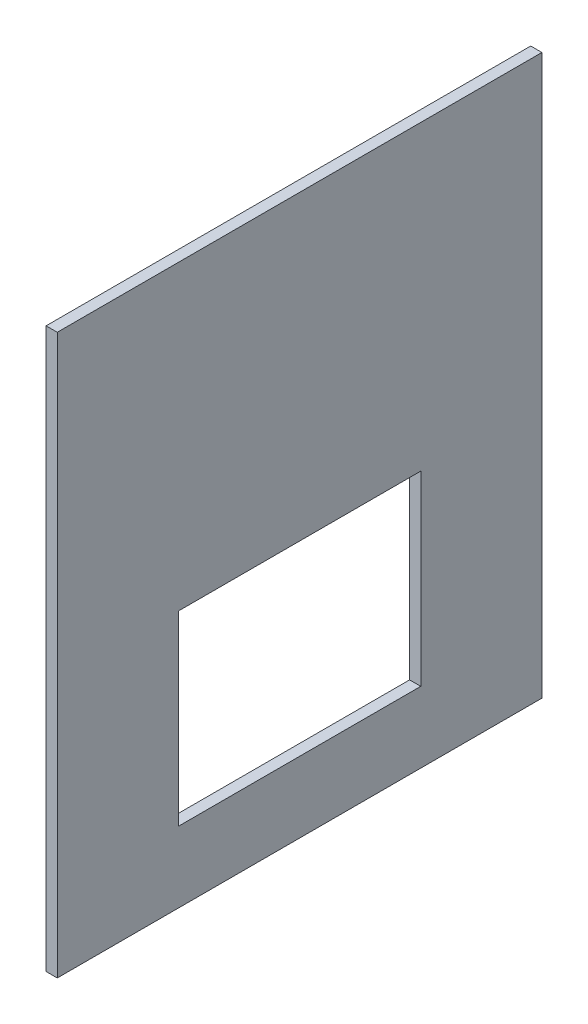
ISO-10303-21;
HEADER;
FILE_DESCRIPTION(('STEP AP214'),'2;1');
FILE_NAME('part.step','',(''),(''),'','','');
FILE_SCHEMA(('AUTOMOTIVE_DESIGN { 1 0 10303 214 1 1 1 1 }'));
ENDSEC;
DATA;
#1=APPLICATION_CONTEXT('core data for automotive mechanical design processes');
#2=APPLICATION_PROTOCOL_DEFINITION('international standard','automotive_design',2000,#1);
#3=PRODUCT_CONTEXT('',#1,'mechanical');
#4=PRODUCT('Part','Part','',(#3));
#5=PRODUCT_RELATED_PRODUCT_CATEGORY('part','',(#4));
#6=PRODUCT_DEFINITION_FORMATION('','',#4);
#7=PRODUCT_DEFINITION_CONTEXT('part definition',#1,'design');
#8=PRODUCT_DEFINITION('design','',#6,#7);
#9=PRODUCT_DEFINITION_SHAPE('','',#8);
#10=(LENGTH_UNIT() NAMED_UNIT(*) SI_UNIT(.MILLI.,.METRE.));
#11=(NAMED_UNIT(*) PLANE_ANGLE_UNIT() SI_UNIT($,.RADIAN.));
#12=(NAMED_UNIT(*) SI_UNIT($,.STERADIAN.) SOLID_ANGLE_UNIT());
#13=UNCERTAINTY_MEASURE_WITH_UNIT(LENGTH_MEASURE(1.E-05),#10,'distance_accuracy_value','');
#14=(GEOMETRIC_REPRESENTATION_CONTEXT(3) GLOBAL_UNCERTAINTY_ASSIGNED_CONTEXT((#13)) GLOBAL_UNIT_ASSIGNED_CONTEXT((#10,
#11,#12)) REPRESENTATION_CONTEXT('',''));
#15=CARTESIAN_POINT('',(0.,0.,0.));
#16=DIRECTION('',(0.,0.,1.));
#17=DIRECTION('',(1.,0.,0.));
#18=AXIS2_PLACEMENT_3D('',#15,#16,#17);
#19=CARTESIAN_POINT('',(3.,0.,0.));
#20=DIRECTION('',(-1.,0.,0.));
#21=DIRECTION('',(0.,0.,1.));
#22=AXIS2_PLACEMENT_3D('',#19,#20,#21);
#23=PLANE('',#22);
#24=DIRECTION('',(0.,-1.,0.));
#25=VECTOR('',#24,1.);
#26=CARTESIAN_POINT('',(3.,0.,0.));
#27=LINE('',#26,#25);
#28=CARTESIAN_POINT('',(3.,150.,0.));
#29=VERTEX_POINT('',#28);
#30=CARTESIAN_POINT('',(3.,0.,0.));
#31=VERTEX_POINT('',#30);
#32=EDGE_CURVE('E134',#29,#31,#27,.T.);
#33=ORIENTED_EDGE('',*,*,#32,.T.);
#34=DIRECTION('',(0.,0.,-1.));
#35=VECTOR('',#34,1.);
#36=CARTESIAN_POINT('',(3.,0.,0.));
#37=LINE('',#36,#35);
#38=CARTESIAN_POINT('',(3.,0.,-130.));
#39=VERTEX_POINT('',#38);
#40=EDGE_CURVE('E137',#31,#39,#37,.T.);
#41=ORIENTED_EDGE('',*,*,#40,.T.);
#42=DIRECTION('',(0.,1.,0.));
#43=VECTOR('',#42,1.);
#44=CARTESIAN_POINT('',(3.,0.,-130.));
#45=LINE('',#44,#43);
#46=CARTESIAN_POINT('',(3.,150.,-130.));
#47=VERTEX_POINT('',#46);
#48=EDGE_CURVE('E140',#39,#47,#45,.T.);
#49=ORIENTED_EDGE('',*,*,#48,.T.);
#50=DIRECTION('',(0.,0.,1.));
#51=VECTOR('',#50,1.);
#52=CARTESIAN_POINT('',(3.,150.,0.));
#53=LINE('',#52,#51);
#54=EDGE_CURVE('E142',#47,#29,#53,.T.);
#55=ORIENTED_EDGE('',*,*,#54,.T.);
#56=EDGE_LOOP('',(#33,#41,#49,#55));
#57=FACE_BOUND('',#56,.T.);
#58=DIRECTION('',(0.,-1.,0.));
#59=VECTOR('',#58,1.);
#60=CARTESIAN_POINT('',(3.,19.,-32.5));
#61=LINE('',#60,#59);
#62=CARTESIAN_POINT('',(3.,69.,-32.5));
#63=VERTEX_POINT('',#62);
#64=CARTESIAN_POINT('',(3.,19.,-32.5));
#65=VERTEX_POINT('',#64);
#66=EDGE_CURVE('E98',#63,#65,#61,.T.);
#67=ORIENTED_EDGE('',*,*,#66,.F.);
#68=DIRECTION('',(0.,0.,1.));
#69=VECTOR('',#68,1.);
#70=CARTESIAN_POINT('',(3.,69.,-32.5));
#71=LINE('',#70,#69);
#72=CARTESIAN_POINT('',(3.,69.,-97.5));
#73=VERTEX_POINT('',#72);
#74=EDGE_CURVE('E120',#73,#63,#71,.T.);
#75=ORIENTED_EDGE('',*,*,#74,.F.);
#76=DIRECTION('',(0.,1.,0.));
#77=VECTOR('',#76,1.);
#78=CARTESIAN_POINT('',(3.,19.,-97.5));
#79=LINE('',#78,#77);
#80=CARTESIAN_POINT('',(3.,19.,-97.5));
#81=VERTEX_POINT('',#80);
#82=EDGE_CURVE('E118',#81,#73,#79,.T.);
#83=ORIENTED_EDGE('',*,*,#82,.F.);
#84=DIRECTION('',(0.,0.,-1.));
#85=VECTOR('',#84,1.);
#86=CARTESIAN_POINT('',(3.,19.,-32.5));
#87=LINE('',#86,#85);
#88=EDGE_CURVE('E106',#65,#81,#87,.T.);
#89=ORIENTED_EDGE('',*,*,#88,.F.);
#90=EDGE_LOOP('',(#67,#75,#83,#89));
#91=FACE_BOUND('',#90,.T.);
#92=ADVANCED_FACE('F33',(#57,#91),#23,.F.);
#93=CARTESIAN_POINT('',(0.,0.,0.));
#94=DIRECTION('',(-1.,0.,0.));
#95=DIRECTION('',(0.,0.,1.));
#96=AXIS2_PLACEMENT_3D('',#93,#94,#95);
#97=PLANE('',#96);
#98=DIRECTION('',(0.,-1.,0.));
#99=VECTOR('',#98,1.);
#100=CARTESIAN_POINT('',(0.,0.,0.));
#101=LINE('',#100,#99);
#102=CARTESIAN_POINT('',(0.,150.,0.));
#103=VERTEX_POINT('',#102);
#104=CARTESIAN_POINT('',(0.,0.,0.));
#105=VERTEX_POINT('',#104);
#106=EDGE_CURVE('E114',#103,#105,#101,.T.);
#107=ORIENTED_EDGE('',*,*,#106,.F.);
#108=DIRECTION('',(0.,0.,1.));
#109=VECTOR('',#108,1.);
#110=CARTESIAN_POINT('',(0.,150.,0.));
#111=LINE('',#110,#109);
#112=CARTESIAN_POINT('',(0.,150.,-130.));
#113=VERTEX_POINT('',#112);
#114=EDGE_CURVE('E138',#113,#103,#111,.T.);
#115=ORIENTED_EDGE('',*,*,#114,.F.);
#116=DIRECTION('',(0.,1.,0.));
#117=VECTOR('',#116,1.);
#118=CARTESIAN_POINT('',(0.,0.,-130.));
#119=LINE('',#118,#117);
#120=CARTESIAN_POINT('',(0.,0.,-130.));
#121=VERTEX_POINT('',#120);
#122=EDGE_CURVE('E149',#121,#113,#119,.T.);
#123=ORIENTED_EDGE('',*,*,#122,.F.);
#124=DIRECTION('',(0.,0.,-1.));
#125=VECTOR('',#124,1.);
#126=CARTESIAN_POINT('',(0.,0.,0.));
#127=LINE('',#126,#125);
#128=EDGE_CURVE('E147',#105,#121,#127,.T.);
#129=ORIENTED_EDGE('',*,*,#128,.F.);
#130=EDGE_LOOP('',(#107,#115,#123,#129));
#131=FACE_BOUND('',#130,.T.);
#132=DIRECTION('',(0.,0.,1.));
#133=VECTOR('',#132,1.);
#134=CARTESIAN_POINT('',(0.,69.,-32.5));
#135=LINE('',#134,#133);
#136=CARTESIAN_POINT('',(0.,69.,-97.5));
#137=VERTEX_POINT('',#136);
#138=CARTESIAN_POINT('',(0.,69.,-32.5));
#139=VERTEX_POINT('',#138);
#140=EDGE_CURVE('E107',#137,#139,#135,.T.);
#141=ORIENTED_EDGE('',*,*,#140,.T.);
#142=DIRECTION('',(0.,-1.,0.));
#143=VECTOR('',#142,1.);
#144=CARTESIAN_POINT('',(0.,19.,-32.5));
#145=LINE('',#144,#143);
#146=CARTESIAN_POINT('',(0.,19.,-32.5));
#147=VERTEX_POINT('',#146);
#148=EDGE_CURVE('E56',#139,#147,#145,.T.);
#149=ORIENTED_EDGE('',*,*,#148,.T.);
#150=DIRECTION('',(0.,0.,-1.));
#151=VECTOR('',#150,1.);
#152=CARTESIAN_POINT('',(0.,19.,-32.5));
#153=LINE('',#152,#151);
#154=CARTESIAN_POINT('',(0.,19.,-97.5));
#155=VERTEX_POINT('',#154);
#156=EDGE_CURVE('E113',#147,#155,#153,.T.);
#157=ORIENTED_EDGE('',*,*,#156,.T.);
#158=DIRECTION('',(0.,1.,0.));
#159=VECTOR('',#158,1.);
#160=CARTESIAN_POINT('',(0.,19.,-97.5));
#161=LINE('',#160,#159);
#162=EDGE_CURVE('E126',#155,#137,#161,.T.);
#163=ORIENTED_EDGE('',*,*,#162,.T.);
#164=EDGE_LOOP('',(#141,#149,#157,#163));
#165=FACE_BOUND('',#164,.T.);
#166=ADVANCED_FACE('F167',(#131,#165),#97,.T.);
#167=CARTESIAN_POINT('',(3.,0.,0.));
#168=DIRECTION('',(0.,0.,-1.));
#169=DIRECTION('',(-1.,0.,0.));
#170=AXIS2_PLACEMENT_3D('',#167,#168,#169);
#171=PLANE('',#170);
#172=ORIENTED_EDGE('',*,*,#106,.T.);
#173=DIRECTION('',(-1.,0.,0.));
#174=VECTOR('',#173,1.);
#175=CARTESIAN_POINT('',(3.,0.,0.));
#176=LINE('',#175,#174);
#177=EDGE_CURVE('E11',#31,#105,#176,.T.);
#178=ORIENTED_EDGE('',*,*,#177,.F.);
#179=ORIENTED_EDGE('',*,*,#32,.F.);
#180=DIRECTION('',(-1.,0.,0.));
#181=VECTOR('',#180,1.);
#182=CARTESIAN_POINT('',(3.,150.,0.));
#183=LINE('',#182,#181);
#184=EDGE_CURVE('E144',#29,#103,#183,.T.);
#185=ORIENTED_EDGE('',*,*,#184,.T.);
#186=EDGE_LOOP('',(#172,#178,#179,#185));
#187=FACE_BOUND('',#186,.T.);
#188=ADVANCED_FACE('F35',(#187),#171,.F.);
#189=CARTESIAN_POINT('',(3.,0.,0.));
#190=DIRECTION('',(0.,1.,0.));
#191=DIRECTION('',(0.,0.,1.));
#192=AXIS2_PLACEMENT_3D('',#189,#190,#191);
#193=PLANE('',#192);
#194=ORIENTED_EDGE('',*,*,#128,.T.);
#195=DIRECTION('',(-1.,0.,0.));
#196=VECTOR('',#195,1.);
#197=CARTESIAN_POINT('',(3.,0.,-130.));
#198=LINE('',#197,#196);
#199=EDGE_CURVE('E41',#39,#121,#198,.T.);
#200=ORIENTED_EDGE('',*,*,#199,.F.);
#201=ORIENTED_EDGE('',*,*,#40,.F.);
#202=ORIENTED_EDGE('',*,*,#177,.T.);
#203=EDGE_LOOP('',(#194,#200,#201,#202));
#204=FACE_BOUND('',#203,.T.);
#205=ADVANCED_FACE('F177',(#204),#193,.F.);
#206=CARTESIAN_POINT('',(3.,0.,-130.));
#207=DIRECTION('',(0.,0.,1.));
#208=DIRECTION('',(1.,0.,0.));
#209=AXIS2_PLACEMENT_3D('',#206,#207,#208);
#210=PLANE('',#209);
#211=ORIENTED_EDGE('',*,*,#122,.T.);
#212=DIRECTION('',(-1.,0.,0.));
#213=VECTOR('',#212,1.);
#214=CARTESIAN_POINT('',(3.,150.,-130.));
#215=LINE('',#214,#213);
#216=EDGE_CURVE('E154',#47,#113,#215,.T.);
#217=ORIENTED_EDGE('',*,*,#216,.F.);
#218=ORIENTED_EDGE('',*,*,#48,.F.);
#219=ORIENTED_EDGE('',*,*,#199,.T.);
#220=EDGE_LOOP('',(#211,#217,#218,#219));
#221=FACE_BOUND('',#220,.T.);
#222=ADVANCED_FACE('F161',(#221),#210,.F.);
#223=CARTESIAN_POINT('',(3.,150.,0.));
#224=DIRECTION('',(0.,-1.,0.));
#225=DIRECTION('',(0.,0.,-1.));
#226=AXIS2_PLACEMENT_3D('',#223,#224,#225);
#227=PLANE('',#226);
#228=ORIENTED_EDGE('',*,*,#114,.T.);
#229=ORIENTED_EDGE('',*,*,#184,.F.);
#230=ORIENTED_EDGE('',*,*,#54,.F.);
#231=ORIENTED_EDGE('',*,*,#216,.T.);
#232=EDGE_LOOP('',(#228,#229,#230,#231));
#233=FACE_BOUND('',#232,.T.);
#234=ADVANCED_FACE('F171',(#233),#227,.F.);
#235=CARTESIAN_POINT('',(3.,19.,-32.5));
#236=DIRECTION('',(0.,0.,-1.));
#237=DIRECTION('',(-1.,0.,0.));
#238=AXIS2_PLACEMENT_3D('',#235,#236,#237);
#239=PLANE('',#238);
#240=ORIENTED_EDGE('',*,*,#148,.F.);
#241=DIRECTION('',(-1.,0.,0.));
#242=VECTOR('',#241,1.);
#243=CARTESIAN_POINT('',(3.,69.,-32.5));
#244=LINE('',#243,#242);
#245=EDGE_CURVE('E102',#63,#139,#244,.T.);
#246=ORIENTED_EDGE('',*,*,#245,.F.);
#247=ORIENTED_EDGE('',*,*,#66,.T.);
#248=DIRECTION('',(-1.,0.,0.));
#249=VECTOR('',#248,1.);
#250=CARTESIAN_POINT('',(3.,19.,-32.5));
#251=LINE('',#250,#249);
#252=EDGE_CURVE('E101',#65,#147,#251,.T.);
#253=ORIENTED_EDGE('',*,*,#252,.T.);
#254=EDGE_LOOP('',(#240,#246,#247,#253));
#255=FACE_BOUND('',#254,.T.);
#256=ADVANCED_FACE('F100',(#255),#239,.T.);
#257=CARTESIAN_POINT('',(3.,19.,-32.5));
#258=DIRECTION('',(0.,1.,0.));
#259=DIRECTION('',(0.,0.,1.));
#260=AXIS2_PLACEMENT_3D('',#257,#258,#259);
#261=PLANE('',#260);
#262=ORIENTED_EDGE('',*,*,#156,.F.);
#263=ORIENTED_EDGE('',*,*,#252,.F.);
#264=ORIENTED_EDGE('',*,*,#88,.T.);
#265=DIRECTION('',(-1.,0.,0.));
#266=VECTOR('',#265,1.);
#267=CARTESIAN_POINT('',(3.,19.,-97.5));
#268=LINE('',#267,#266);
#269=EDGE_CURVE('E115',#81,#155,#268,.T.);
#270=ORIENTED_EDGE('',*,*,#269,.T.);
#271=EDGE_LOOP('',(#262,#263,#264,#270));
#272=FACE_BOUND('',#271,.T.);
#273=ADVANCED_FACE('F110',(#272),#261,.T.);
#274=CARTESIAN_POINT('',(3.,19.,-97.5));
#275=DIRECTION('',(0.,0.,1.));
#276=DIRECTION('',(1.,0.,0.));
#277=AXIS2_PLACEMENT_3D('',#274,#275,#276);
#278=PLANE('',#277);
#279=ORIENTED_EDGE('',*,*,#162,.F.);
#280=ORIENTED_EDGE('',*,*,#269,.F.);
#281=ORIENTED_EDGE('',*,*,#82,.T.);
#282=DIRECTION('',(-1.,0.,0.));
#283=VECTOR('',#282,1.);
#284=CARTESIAN_POINT('',(3.,69.,-97.5));
#285=LINE('',#284,#283);
#286=EDGE_CURVE('E48',#73,#137,#285,.T.);
#287=ORIENTED_EDGE('',*,*,#286,.T.);
#288=EDGE_LOOP('',(#279,#280,#281,#287));
#289=FACE_BOUND('',#288,.T.);
#290=ADVANCED_FACE('F200',(#289),#278,.T.);
#291=CARTESIAN_POINT('',(3.,69.,-32.5));
#292=DIRECTION('',(0.,-1.,0.));
#293=DIRECTION('',(0.,0.,-1.));
#294=AXIS2_PLACEMENT_3D('',#291,#292,#293);
#295=PLANE('',#294);
#296=ORIENTED_EDGE('',*,*,#140,.F.);
#297=ORIENTED_EDGE('',*,*,#286,.F.);
#298=ORIENTED_EDGE('',*,*,#74,.T.);
#299=ORIENTED_EDGE('',*,*,#245,.T.);
#300=EDGE_LOOP('',(#296,#297,#298,#299));
#301=FACE_BOUND('',#300,.T.);
#302=ADVANCED_FACE('F204',(#301),#295,.T.);
#303=CLOSED_SHELL('',(#92,#166,#188,#205,#222,#234,#256,#273,#290,#302));
#304=MANIFOLD_SOLID_BREP('B2',#303);
#305=ADVANCED_BREP_SHAPE_REPRESENTATION('',(#18,#304),#14);
#306=SHAPE_DEFINITION_REPRESENTATION(#9,#305);
ENDSEC;
END-ISO-10303-21;
